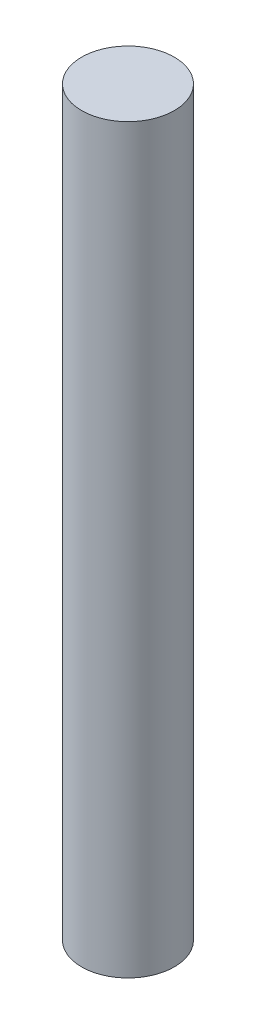
ISO-10303-21;
HEADER;
FILE_DESCRIPTION(('STEP AP214'),'2;1');
FILE_NAME('part.step','',(''),(''),'','','');
FILE_SCHEMA(('AUTOMOTIVE_DESIGN { 1 0 10303 214 1 1 1 1 }'));
ENDSEC;
DATA;
#1=APPLICATION_CONTEXT('core data for automotive mechanical design processes');
#2=APPLICATION_PROTOCOL_DEFINITION('international standard','automotive_design',2000,#1);
#3=PRODUCT_CONTEXT('',#1,'mechanical');
#4=PRODUCT('Part','Part','',(#3));
#5=PRODUCT_RELATED_PRODUCT_CATEGORY('part','',(#4));
#6=PRODUCT_DEFINITION_FORMATION('','',#4);
#7=PRODUCT_DEFINITION_CONTEXT('part definition',#1,'design');
#8=PRODUCT_DEFINITION('design','',#6,#7);
#9=PRODUCT_DEFINITION_SHAPE('','',#8);
#10=(LENGTH_UNIT() NAMED_UNIT(*) SI_UNIT(.MILLI.,.METRE.));
#11=(NAMED_UNIT(*) PLANE_ANGLE_UNIT() SI_UNIT($,.RADIAN.));
#12=(NAMED_UNIT(*) SI_UNIT($,.STERADIAN.) SOLID_ANGLE_UNIT());
#13=UNCERTAINTY_MEASURE_WITH_UNIT(LENGTH_MEASURE(1.E-05),#10,'distance_accuracy_value','');
#14=(GEOMETRIC_REPRESENTATION_CONTEXT(3) GLOBAL_UNCERTAINTY_ASSIGNED_CONTEXT((#13)) GLOBAL_UNIT_ASSIGNED_CONTEXT((#10,
#11,#12)) REPRESENTATION_CONTEXT('',''));
#15=CARTESIAN_POINT('',(0.,0.,0.));
#16=DIRECTION('',(0.,0.,1.));
#17=DIRECTION('',(1.,0.,0.));
#18=AXIS2_PLACEMENT_3D('',#15,#16,#17);
#19=CARTESIAN_POINT('',(0.,76.2,0.));
#20=DIRECTION('',(0.,-1.,0.));
#21=DIRECTION('',(0.,0.,-1.));
#22=AXIS2_PLACEMENT_3D('',#19,#20,#21);
#23=CYLINDRICAL_SURFACE('',#22,4.7625);
#24=CARTESIAN_POINT('',(0.,76.2,0.));
#25=DIRECTION('',(0.,1.,0.));
#26=DIRECTION('',(0.,0.,1.));
#27=AXIS2_PLACEMENT_3D('',#24,#25,#26);
#28=CIRCLE('',#27,4.7625);
#29=CARTESIAN_POINT('',(0.,76.2,4.7625));
#30=VERTEX_POINT('',#29);
#31=EDGE_CURVE('E10',#30,#30,#28,.T.);
#32=ORIENTED_EDGE('',*,*,#31,.F.);
#33=EDGE_LOOP('',(#32));
#34=FACE_BOUND('',#33,.T.);
#35=CARTESIAN_POINT('',(0.,0.,0.));
#36=DIRECTION('',(0.,1.,0.));
#37=DIRECTION('',(0.,0.,1.));
#38=AXIS2_PLACEMENT_3D('',#35,#36,#37);
#39=CIRCLE('',#38,4.7625);
#40=CARTESIAN_POINT('',(0.,0.,4.7625));
#41=VERTEX_POINT('',#40);
#42=EDGE_CURVE('E34',#41,#41,#39,.T.);
#43=ORIENTED_EDGE('',*,*,#42,.T.);
#44=EDGE_LOOP('',(#43));
#45=FACE_BOUND('',#44,.T.);
#46=ADVANCED_FACE('F31',(#34,#45),#23,.T.);
#47=CARTESIAN_POINT('',(0.,76.2,0.));
#48=DIRECTION('',(0.,1.,0.));
#49=DIRECTION('',(0.,0.,1.));
#50=AXIS2_PLACEMENT_3D('',#47,#48,#49);
#51=PLANE('',#50);
#52=ORIENTED_EDGE('',*,*,#31,.T.);
#53=EDGE_LOOP('',(#52));
#54=FACE_BOUND('',#53,.T.);
#55=ADVANCED_FACE('F46',(#54),#51,.T.);
#56=CARTESIAN_POINT('',(0.,0.,0.));
#57=DIRECTION('',(0.,1.,0.));
#58=DIRECTION('',(0.,0.,1.));
#59=AXIS2_PLACEMENT_3D('',#56,#57,#58);
#60=PLANE('',#59);
#61=ORIENTED_EDGE('',*,*,#42,.F.);
#62=EDGE_LOOP('',(#61));
#63=FACE_BOUND('',#62,.T.);
#64=ADVANCED_FACE('F44',(#63),#60,.F.);
#65=CLOSED_SHELL('',(#46,#55,#64));
#66=MANIFOLD_SOLID_BREP('B2',#65);
#67=ADVANCED_BREP_SHAPE_REPRESENTATION('',(#18,#66),#14);
#68=SHAPE_DEFINITION_REPRESENTATION(#9,#67);
ENDSEC;
END-ISO-10303-21;
